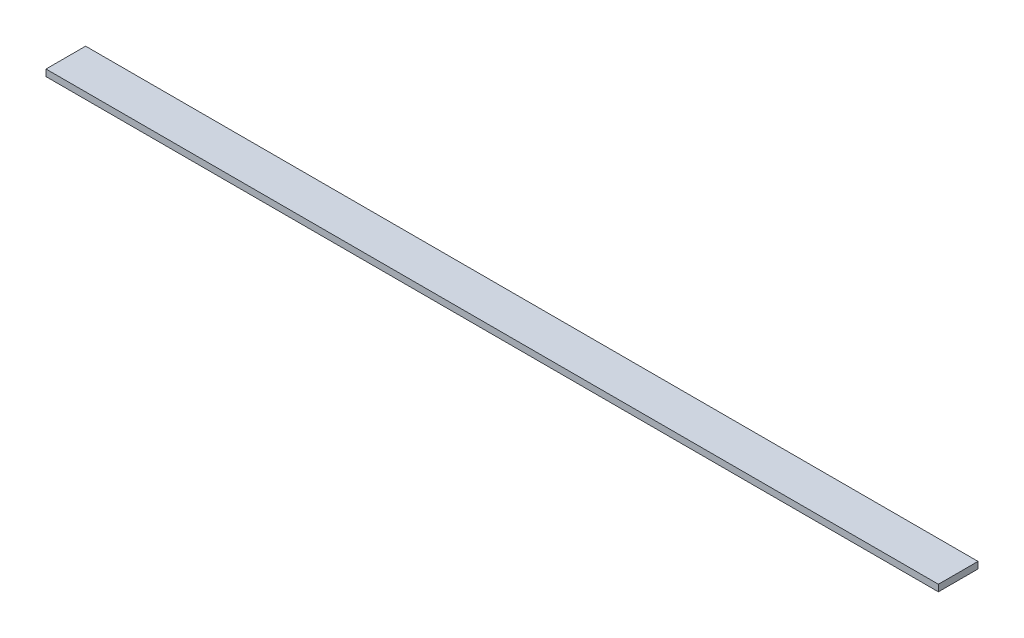
ISO-10303-21;
HEADER;
FILE_DESCRIPTION(('STEP AP214'),'2;1');
FILE_NAME('part.step','',(''),(''),'','','');
FILE_SCHEMA(('AUTOMOTIVE_DESIGN { 1 0 10303 214 1 1 1 1 }'));
ENDSEC;
DATA;
#1=APPLICATION_CONTEXT('core data for automotive mechanical design processes');
#2=APPLICATION_PROTOCOL_DEFINITION('international standard','automotive_design',2000,#1);
#3=PRODUCT_CONTEXT('',#1,'mechanical');
#4=PRODUCT('Part','Part','',(#3));
#5=PRODUCT_RELATED_PRODUCT_CATEGORY('part','',(#4));
#6=PRODUCT_DEFINITION_FORMATION('','',#4);
#7=PRODUCT_DEFINITION_CONTEXT('part definition',#1,'design');
#8=PRODUCT_DEFINITION('design','',#6,#7);
#9=PRODUCT_DEFINITION_SHAPE('','',#8);
#10=(LENGTH_UNIT() NAMED_UNIT(*) SI_UNIT(.MILLI.,.METRE.));
#11=(NAMED_UNIT(*) PLANE_ANGLE_UNIT() SI_UNIT($,.RADIAN.));
#12=(NAMED_UNIT(*) SI_UNIT($,.STERADIAN.) SOLID_ANGLE_UNIT());
#13=UNCERTAINTY_MEASURE_WITH_UNIT(LENGTH_MEASURE(1.E-05),#10,'distance_accuracy_value','');
#14=(GEOMETRIC_REPRESENTATION_CONTEXT(3) GLOBAL_UNCERTAINTY_ASSIGNED_CONTEXT((#13)) GLOBAL_UNIT_ASSIGNED_CONTEXT((#10,
#11,#12)) REPRESENTATION_CONTEXT('',''));
#15=CARTESIAN_POINT('',(0.,0.,0.));
#16=DIRECTION('',(0.,0.,1.));
#17=DIRECTION('',(1.,0.,0.));
#18=AXIS2_PLACEMENT_3D('',#15,#16,#17);
#19=CARTESIAN_POINT('',(0.,3.175,0.));
#20=DIRECTION('',(-1.,0.,0.));
#21=DIRECTION('',(0.,0.,1.));
#22=AXIS2_PLACEMENT_3D('',#19,#20,#21);
#23=PLANE('',#22);
#24=DIRECTION('',(0.,0.,-1.));
#25=VECTOR('',#24,1.);
#26=CARTESIAN_POINT('',(0.,0.,0.));
#27=LINE('',#26,#25);
#28=CARTESIAN_POINT('',(0.,0.,19.05));
#29=VERTEX_POINT('',#28);
#30=CARTESIAN_POINT('',(0.,0.,0.));
#31=VERTEX_POINT('',#30);
#32=EDGE_CURVE('E98',#29,#31,#27,.T.);
#33=ORIENTED_EDGE('',*,*,#32,.T.);
#34=DIRECTION('',(0.,-1.,0.));
#35=VECTOR('',#34,1.);
#36=CARTESIAN_POINT('',(0.,3.175,0.));
#37=LINE('',#36,#35);
#38=CARTESIAN_POINT('',(0.,3.175,0.));
#39=VERTEX_POINT('',#38);
#40=EDGE_CURVE('E11',#39,#31,#37,.T.);
#41=ORIENTED_EDGE('',*,*,#40,.F.);
#42=DIRECTION('',(0.,0.,-1.));
#43=VECTOR('',#42,1.);
#44=CARTESIAN_POINT('',(0.,3.175,0.));
#45=LINE('',#44,#43);
#46=CARTESIAN_POINT('',(0.,3.175,19.05));
#47=VERTEX_POINT('',#46);
#48=EDGE_CURVE('E86',#47,#39,#45,.T.);
#49=ORIENTED_EDGE('',*,*,#48,.F.);
#50=DIRECTION('',(0.,-1.,0.));
#51=VECTOR('',#50,1.);
#52=CARTESIAN_POINT('',(0.,3.175,19.05));
#53=LINE('',#52,#51);
#54=EDGE_CURVE('E94',#47,#29,#53,.T.);
#55=ORIENTED_EDGE('',*,*,#54,.T.);
#56=EDGE_LOOP('',(#33,#41,#49,#55));
#57=FACE_BOUND('',#56,.T.);
#58=ADVANCED_FACE('F35',(#57),#23,.F.);
#59=CARTESIAN_POINT('',(0.,3.175,0.));
#60=DIRECTION('',(0.,0.,1.));
#61=DIRECTION('',(1.,0.,0.));
#62=AXIS2_PLACEMENT_3D('',#59,#60,#61);
#63=PLANE('',#62);
#64=DIRECTION('',(-1.,0.,0.));
#65=VECTOR('',#64,1.);
#66=CARTESIAN_POINT('',(0.,0.,0.));
#67=LINE('',#66,#65);
#68=CARTESIAN_POINT('',(-429.26,0.,0.));
#69=VERTEX_POINT('',#68);
#70=EDGE_CURVE('E90',#31,#69,#67,.T.);
#71=ORIENTED_EDGE('',*,*,#70,.T.);
#72=DIRECTION('',(0.,-1.,0.));
#73=VECTOR('',#72,1.);
#74=CARTESIAN_POINT('',(-429.26,3.175,0.));
#75=LINE('',#74,#73);
#76=CARTESIAN_POINT('',(-429.26,3.175,0.));
#77=VERTEX_POINT('',#76);
#78=EDGE_CURVE('E43',#77,#69,#75,.T.);
#79=ORIENTED_EDGE('',*,*,#78,.F.);
#80=DIRECTION('',(-1.,0.,0.));
#81=VECTOR('',#80,1.);
#82=CARTESIAN_POINT('',(0.,3.175,0.));
#83=LINE('',#82,#81);
#84=EDGE_CURVE('E81',#39,#77,#83,.T.);
#85=ORIENTED_EDGE('',*,*,#84,.F.);
#86=ORIENTED_EDGE('',*,*,#40,.T.);
#87=EDGE_LOOP('',(#71,#79,#85,#86));
#88=FACE_BOUND('',#87,.T.);
#89=ADVANCED_FACE('F89',(#88),#63,.F.);
#90=CARTESIAN_POINT('',(-429.26,3.175,0.));
#91=DIRECTION('',(1.,0.,0.));
#92=DIRECTION('',(0.,0.,-1.));
#93=AXIS2_PLACEMENT_3D('',#90,#91,#92);
#94=PLANE('',#93);
#95=DIRECTION('',(0.,0.,1.));
#96=VECTOR('',#95,1.);
#97=CARTESIAN_POINT('',(-429.26,0.,0.));
#98=LINE('',#97,#96);
#99=CARTESIAN_POINT('',(-429.26,0.,19.0500000000001));
#100=VERTEX_POINT('',#99);
#101=EDGE_CURVE('E68',#69,#100,#98,.T.);
#102=ORIENTED_EDGE('',*,*,#101,.T.);
#103=DIRECTION('',(0.,-1.,0.));
#104=VECTOR('',#103,1.);
#105=CARTESIAN_POINT('',(-429.26,3.175,19.0500000000001));
#106=LINE('',#105,#104);
#107=CARTESIAN_POINT('',(-429.26,3.175,19.0500000000001));
#108=VERTEX_POINT('',#107);
#109=EDGE_CURVE('E91',#108,#100,#106,.T.);
#110=ORIENTED_EDGE('',*,*,#109,.F.);
#111=DIRECTION('',(0.,0.,1.));
#112=VECTOR('',#111,1.);
#113=CARTESIAN_POINT('',(-429.26,3.175,0.));
#114=LINE('',#113,#112);
#115=EDGE_CURVE('E84',#77,#108,#114,.T.);
#116=ORIENTED_EDGE('',*,*,#115,.F.);
#117=ORIENTED_EDGE('',*,*,#78,.T.);
#118=EDGE_LOOP('',(#102,#110,#116,#117));
#119=FACE_BOUND('',#118,.T.);
#120=ADVANCED_FACE('F92',(#119),#94,.F.);
#121=CARTESIAN_POINT('',(0.,3.175,19.05));
#122=DIRECTION('',(0.,0.,-1.));
#123=DIRECTION('',(-1.,0.,0.));
#124=AXIS2_PLACEMENT_3D('',#121,#122,#123);
#125=PLANE('',#124);
#126=DIRECTION('',(1.,0.,0.));
#127=VECTOR('',#126,1.);
#128=CARTESIAN_POINT('',(0.,0.,19.05));
#129=LINE('',#128,#127);
#130=EDGE_CURVE('E74',#100,#29,#129,.T.);
#131=ORIENTED_EDGE('',*,*,#130,.T.);
#132=ORIENTED_EDGE('',*,*,#54,.F.);
#133=DIRECTION('',(1.,0.,0.));
#134=VECTOR('',#133,1.);
#135=CARTESIAN_POINT('',(0.,3.175,19.05));
#136=LINE('',#135,#134);
#137=EDGE_CURVE('E51',#108,#47,#136,.T.);
#138=ORIENTED_EDGE('',*,*,#137,.F.);
#139=ORIENTED_EDGE('',*,*,#109,.T.);
#140=EDGE_LOOP('',(#131,#132,#138,#139));
#141=FACE_BOUND('',#140,.T.);
#142=ADVANCED_FACE('F105',(#141),#125,.F.);
#143=CARTESIAN_POINT('',(0.,3.175,0.));
#144=DIRECTION('',(0.,-1.,0.));
#145=DIRECTION('',(0.,0.,-1.));
#146=AXIS2_PLACEMENT_3D('',#143,#144,#145);
#147=PLANE('',#146);
#148=ORIENTED_EDGE('',*,*,#48,.T.);
#149=ORIENTED_EDGE('',*,*,#84,.T.);
#150=ORIENTED_EDGE('',*,*,#115,.T.);
#151=ORIENTED_EDGE('',*,*,#137,.T.);
#152=EDGE_LOOP('',(#148,#149,#150,#151));
#153=FACE_BOUND('',#152,.T.);
#154=ADVANCED_FACE('F82',(#153),#147,.F.);
#155=CARTESIAN_POINT('',(0.,0.,0.));
#156=DIRECTION('',(0.,-1.,0.));
#157=DIRECTION('',(0.,0.,-1.));
#158=AXIS2_PLACEMENT_3D('',#155,#156,#157);
#159=PLANE('',#158);
#160=ORIENTED_EDGE('',*,*,#32,.F.);
#161=ORIENTED_EDGE('',*,*,#130,.F.);
#162=ORIENTED_EDGE('',*,*,#101,.F.);
#163=ORIENTED_EDGE('',*,*,#70,.F.);
#164=EDGE_LOOP('',(#160,#161,#162,#163));
#165=FACE_BOUND('',#164,.T.);
#166=ADVANCED_FACE('F108',(#165),#159,.T.);
#167=CLOSED_SHELL('',(#58,#89,#120,#142,#154,#166));
#168=MANIFOLD_SOLID_BREP('B2',#167);
#169=ADVANCED_BREP_SHAPE_REPRESENTATION('',(#18,#168),#14);
#170=SHAPE_DEFINITION_REPRESENTATION(#9,#169);
ENDSEC;
END-ISO-10303-21;
